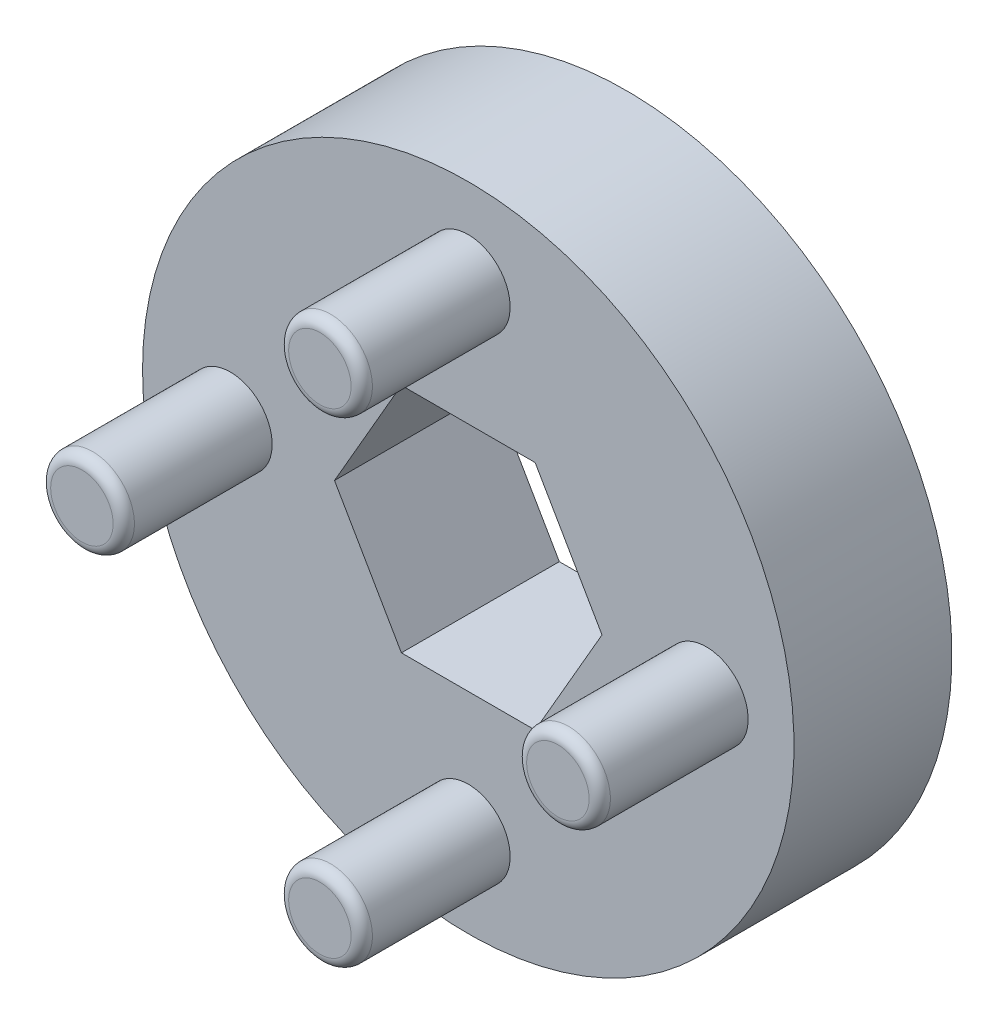
ISO-10303-21;
HEADER;
FILE_DESCRIPTION(('STEP AP214'),'2;1');
FILE_NAME('part.step','',(''),(''),'','','');
FILE_SCHEMA(('AUTOMOTIVE_DESIGN { 1 0 10303 214 1 1 1 1 }'));
ENDSEC;
DATA;
#1=APPLICATION_CONTEXT('core data for automotive mechanical design processes');
#2=APPLICATION_PROTOCOL_DEFINITION('international standard','automotive_design',2000,#1);
#3=PRODUCT_CONTEXT('',#1,'mechanical');
#4=PRODUCT('Part','Part','',(#3));
#5=PRODUCT_RELATED_PRODUCT_CATEGORY('part','',(#4));
#6=PRODUCT_DEFINITION_FORMATION('','',#4);
#7=PRODUCT_DEFINITION_CONTEXT('part definition',#1,'design');
#8=PRODUCT_DEFINITION('design','',#6,#7);
#9=PRODUCT_DEFINITION_SHAPE('','',#8);
#10=(LENGTH_UNIT() NAMED_UNIT(*) SI_UNIT(.MILLI.,.METRE.));
#11=(NAMED_UNIT(*) PLANE_ANGLE_UNIT() SI_UNIT($,.RADIAN.));
#12=(NAMED_UNIT(*) SI_UNIT($,.STERADIAN.) SOLID_ANGLE_UNIT());
#13=UNCERTAINTY_MEASURE_WITH_UNIT(LENGTH_MEASURE(1.E-05),#10,'distance_accuracy_value','');
#14=(GEOMETRIC_REPRESENTATION_CONTEXT(3) GLOBAL_UNCERTAINTY_ASSIGNED_CONTEXT((#13)) GLOBAL_UNIT_ASSIGNED_CONTEXT((#10,
#11,#12)) REPRESENTATION_CONTEXT('',''));
#15=CARTESIAN_POINT('',(0.,0.,0.));
#16=DIRECTION('',(0.,0.,1.));
#17=DIRECTION('',(1.,0.,0.));
#18=AXIS2_PLACEMENT_3D('',#15,#16,#17);
#19=CARTESIAN_POINT('',(-11.3665,1.19057767913881E-13,14.6304));
#20=DIRECTION('',(0.,0.,1.));
#21=DIRECTION('',(1.,0.,0.));
#22=AXIS2_PLACEMENT_3D('',#19,#20,#21);
#23=PLANE('',#22);
#24=CARTESIAN_POINT('',(-11.3665,1.19057767913881E-13,14.6304));
#25=DIRECTION('',(0.,0.,-1.));
#26=DIRECTION('',(-1.,0.,0.));
#27=AXIS2_PLACEMENT_3D('',#24,#25,#26);
#28=CIRCLE('',#27,1.49225);
#29=CARTESIAN_POINT('',(-12.85875,1.19252958243964E-13,14.6304));
#30=VERTEX_POINT('',#29);
#31=CARTESIAN_POINT('',(-9.87425,1.19057767913881E-13,14.6304));
#32=VERTEX_POINT('',#31);
#33=EDGE_CURVE('E95',#30,#32,#28,.T.);
#34=ORIENTED_EDGE('',*,*,#33,.F.);
#35=CARTESIAN_POINT('',(-11.3665,1.19057767913881E-13,14.6304));
#36=DIRECTION('',(0.,0.,-1.));
#37=DIRECTION('',(1.,0.,0.));
#38=AXIS2_PLACEMENT_3D('',#35,#36,#37);
#39=CIRCLE('',#38,1.49225);
#40=EDGE_CURVE('E93',#32,#30,#39,.T.);
#41=ORIENTED_EDGE('',*,*,#40,.F.);
#42=EDGE_LOOP('',(#34,#41));
#43=FACE_BOUND('',#42,.T.);
#44=ADVANCED_FACE('F17',(#43),#23,.T.);
#45=CARTESIAN_POINT('',(0.,-11.3665,14.6304));
#46=DIRECTION('',(0.,0.,1.));
#47=DIRECTION('',(1.,0.,0.));
#48=AXIS2_PLACEMENT_3D('',#45,#46,#47);
#49=PLANE('',#48);
#50=CARTESIAN_POINT('',(0.,-11.3665,14.6304));
#51=DIRECTION('',(0.,0.,-1.));
#52=DIRECTION('',(-1.,0.,0.));
#53=AXIS2_PLACEMENT_3D('',#50,#51,#52);
#54=CIRCLE('',#53,1.49225);
#55=CARTESIAN_POINT('',(-1.49225,-11.3665,14.6304));
#56=VERTEX_POINT('',#55);
#57=CARTESIAN_POINT('',(1.49225,-11.3665,14.6304));
#58=VERTEX_POINT('',#57);
#59=EDGE_CURVE('E330',#56,#58,#54,.T.);
#60=ORIENTED_EDGE('',*,*,#59,.F.);
#61=CARTESIAN_POINT('',(0.,-11.3665,14.6304));
#62=DIRECTION('',(0.,0.,-1.));
#63=DIRECTION('',(1.,0.,0.));
#64=AXIS2_PLACEMENT_3D('',#61,#62,#63);
#65=CIRCLE('',#64,1.49225);
#66=EDGE_CURVE('E101',#58,#56,#65,.T.);
#67=ORIENTED_EDGE('',*,*,#66,.F.);
#68=EDGE_LOOP('',(#60,#67));
#69=FACE_BOUND('',#68,.T.);
#70=ADVANCED_FACE('F334',(#69),#49,.T.);
#71=CARTESIAN_POINT('',(11.3665,0.,14.6304));
#72=DIRECTION('',(0.,0.,1.));
#73=DIRECTION('',(1.,0.,0.));
#74=AXIS2_PLACEMENT_3D('',#71,#72,#73);
#75=PLANE('',#74);
#76=CARTESIAN_POINT('',(11.3665,0.,14.6304));
#77=DIRECTION('',(0.,0.,-1.));
#78=DIRECTION('',(-1.,0.,0.));
#79=AXIS2_PLACEMENT_3D('',#76,#77,#78);
#80=CIRCLE('',#79,1.49225);
#81=CARTESIAN_POINT('',(9.87425,0.,14.6304));
#82=VERTEX_POINT('',#81);
#83=CARTESIAN_POINT('',(12.85875,0.,14.6304));
#84=VERTEX_POINT('',#83);
#85=EDGE_CURVE('E495',#82,#84,#80,.T.);
#86=ORIENTED_EDGE('',*,*,#85,.F.);
#87=CARTESIAN_POINT('',(11.3665,0.,14.6304));
#88=DIRECTION('',(0.,0.,-1.));
#89=DIRECTION('',(1.,0.,0.));
#90=AXIS2_PLACEMENT_3D('',#87,#88,#89);
#91=CIRCLE('',#90,1.49225);
#92=EDGE_CURVE('E311',#84,#82,#91,.T.);
#93=ORIENTED_EDGE('',*,*,#92,.F.);
#94=EDGE_LOOP('',(#86,#93));
#95=FACE_BOUND('',#94,.T.);
#96=ADVANCED_FACE('F171',(#95),#75,.T.);
#97=CARTESIAN_POINT('',(0.,11.3665,14.6304));
#98=DIRECTION('',(0.,0.,1.));
#99=DIRECTION('',(1.,0.,0.));
#100=AXIS2_PLACEMENT_3D('',#97,#98,#99);
#101=PLANE('',#100);
#102=CARTESIAN_POINT('',(0.,11.3665,14.6304));
#103=DIRECTION('',(0.,0.,-1.));
#104=DIRECTION('',(-1.,0.,0.));
#105=AXIS2_PLACEMENT_3D('',#102,#103,#104);
#106=CIRCLE('',#105,1.49225);
#107=CARTESIAN_POINT('',(-1.49225,11.3665,14.6304));
#108=VERTEX_POINT('',#107);
#109=CARTESIAN_POINT('',(1.49225,11.3665,14.6304));
#110=VERTEX_POINT('',#109);
#111=EDGE_CURVE('E151',#108,#110,#106,.T.);
#112=ORIENTED_EDGE('',*,*,#111,.F.);
#113=CARTESIAN_POINT('',(0.,11.3665,14.6304));
#114=DIRECTION('',(0.,0.,-1.));
#115=DIRECTION('',(1.,0.,0.));
#116=AXIS2_PLACEMENT_3D('',#113,#114,#115);
#117=CIRCLE('',#116,1.49225);
#118=EDGE_CURVE('E299',#110,#108,#117,.T.);
#119=ORIENTED_EDGE('',*,*,#118,.F.);
#120=EDGE_LOOP('',(#112,#119));
#121=FACE_BOUND('',#120,.T.);
#122=ADVANCED_FACE('F162',(#121),#101,.T.);
#123=CARTESIAN_POINT('',(-11.3665,1.19057767913881E-13,14.1224));
#124=DIRECTION('',(0.,0.,1.));
#125=DIRECTION('',(1.,0.,0.));
#126=AXIS2_PLACEMENT_3D('',#123,#124,#125);
#127=TOROIDAL_SURFACE('',#126,1.49225,0.508);
#128=ORIENTED_EDGE('',*,*,#40,.T.);
#129=ORIENTED_EDGE('',*,*,#33,.T.);
#130=EDGE_LOOP('',(#128,#129));
#131=FACE_BOUND('',#130,.T.);
#132=CARTESIAN_POINT('',(-11.3665,1.19057767913881E-13,14.1224));
#133=DIRECTION('',(0.,0.,-1.));
#134=DIRECTION('',(-1.,0.,0.));
#135=AXIS2_PLACEMENT_3D('',#132,#133,#134);
#136=CIRCLE('',#135,2.00025);
#137=CARTESIAN_POINT('',(-13.36675,1.19057767913881E-13,14.1224));
#138=VERTEX_POINT('',#137);
#139=EDGE_CURVE('E149',#138,#138,#136,.T.);
#140=ORIENTED_EDGE('',*,*,#139,.F.);
#141=EDGE_LOOP('',(#140));
#142=FACE_BOUND('',#141,.T.);
#143=ADVANCED_FACE('F97',(#131,#142),#127,.T.);
#144=CARTESIAN_POINT('',(0.,-11.3665,14.1224));
#145=DIRECTION('',(0.,0.,1.));
#146=DIRECTION('',(1.,0.,0.));
#147=AXIS2_PLACEMENT_3D('',#144,#145,#146);
#148=TOROIDAL_SURFACE('',#147,1.49225,0.508);
#149=ORIENTED_EDGE('',*,*,#66,.T.);
#150=ORIENTED_EDGE('',*,*,#59,.T.);
#151=EDGE_LOOP('',(#149,#150));
#152=FACE_BOUND('',#151,.T.);
#153=CARTESIAN_POINT('',(0.,-11.3665,14.1224));
#154=DIRECTION('',(0.,0.,-1.));
#155=DIRECTION('',(-1.,0.,0.));
#156=AXIS2_PLACEMENT_3D('',#153,#154,#155);
#157=CIRCLE('',#156,2.00025);
#158=CARTESIAN_POINT('',(-2.00025,-11.3665,14.1224));
#159=VERTEX_POINT('',#158);
#160=EDGE_CURVE('E148',#159,#159,#157,.T.);
#161=ORIENTED_EDGE('',*,*,#160,.F.);
#162=EDGE_LOOP('',(#161));
#163=FACE_BOUND('',#162,.T.);
#164=ADVANCED_FACE('F126',(#152,#163),#148,.T.);
#165=CARTESIAN_POINT('',(11.3665,0.,14.1224));
#166=DIRECTION('',(0.,0.,1.));
#167=DIRECTION('',(1.,0.,0.));
#168=AXIS2_PLACEMENT_3D('',#165,#166,#167);
#169=TOROIDAL_SURFACE('',#168,1.49225,0.508);
#170=ORIENTED_EDGE('',*,*,#92,.T.);
#171=ORIENTED_EDGE('',*,*,#85,.T.);
#172=EDGE_LOOP('',(#170,#171));
#173=FACE_BOUND('',#172,.T.);
#174=CARTESIAN_POINT('',(11.3665,0.,14.1224));
#175=DIRECTION('',(0.,0.,-1.));
#176=DIRECTION('',(-1.,0.,0.));
#177=AXIS2_PLACEMENT_3D('',#174,#175,#176);
#178=CIRCLE('',#177,2.00025);
#179=CARTESIAN_POINT('',(9.36625,0.,14.1224));
#180=VERTEX_POINT('',#179);
#181=EDGE_CURVE('E207',#180,#180,#178,.T.);
#182=ORIENTED_EDGE('',*,*,#181,.F.);
#183=EDGE_LOOP('',(#182));
#184=FACE_BOUND('',#183,.T.);
#185=ADVANCED_FACE('F136',(#173,#184),#169,.T.);
#186=CARTESIAN_POINT('',(0.,11.3665,14.1224));
#187=DIRECTION('',(0.,0.,1.));
#188=DIRECTION('',(1.,0.,0.));
#189=AXIS2_PLACEMENT_3D('',#186,#187,#188);
#190=TOROIDAL_SURFACE('',#189,1.49225,0.508);
#191=ORIENTED_EDGE('',*,*,#118,.T.);
#192=ORIENTED_EDGE('',*,*,#111,.T.);
#193=EDGE_LOOP('',(#191,#192));
#194=FACE_BOUND('',#193,.T.);
#195=CARTESIAN_POINT('',(0.,11.3665,14.1224));
#196=DIRECTION('',(0.,0.,-1.));
#197=DIRECTION('',(-1.,0.,0.));
#198=AXIS2_PLACEMENT_3D('',#195,#196,#197);
#199=CIRCLE('',#198,2.00025);
#200=CARTESIAN_POINT('',(-2.00025,11.3665,14.1224));
#201=VERTEX_POINT('',#200);
#202=EDGE_CURVE('E205',#201,#201,#199,.T.);
#203=ORIENTED_EDGE('',*,*,#202,.F.);
#204=EDGE_LOOP('',(#203));
#205=FACE_BOUND('',#204,.T.);
#206=ADVANCED_FACE('F189',(#194,#205),#190,.T.);
#207=CARTESIAN_POINT('',(-11.3665,1.19057767913881E-13,14.6304));
#208=DIRECTION('',(0.,0.,-1.));
#209=DIRECTION('',(-1.,0.,0.));
#210=AXIS2_PLACEMENT_3D('',#207,#208,#209);
#211=CYLINDRICAL_SURFACE('',#210,2.00025);
#212=CARTESIAN_POINT('',(-11.3665,1.19057767913881E-13,7.5438));
#213=DIRECTION('',(0.,0.,-1.));
#214=DIRECTION('',(-1.,0.,0.));
#215=AXIS2_PLACEMENT_3D('',#212,#213,#214);
#216=CIRCLE('',#215,2.00025);
#217=CARTESIAN_POINT('',(-13.36675,1.19057767913881E-13,7.5438));
#218=VERTEX_POINT('',#217);
#219=EDGE_CURVE('E213',#218,#218,#216,.T.);
#220=ORIENTED_EDGE('',*,*,#219,.F.);
#221=EDGE_LOOP('',(#220));
#222=FACE_BOUND('',#221,.T.);
#223=ORIENTED_EDGE('',*,*,#139,.T.);
#224=EDGE_LOOP('',(#223));
#225=FACE_BOUND('',#224,.T.);
#226=ADVANCED_FACE('F199',(#222,#225),#211,.T.);
#227=CARTESIAN_POINT('',(0.,-11.3665,14.6304));
#228=DIRECTION('',(0.,0.,-1.));
#229=DIRECTION('',(-1.,0.,0.));
#230=AXIS2_PLACEMENT_3D('',#227,#228,#229);
#231=CYLINDRICAL_SURFACE('',#230,2.00025);
#232=CARTESIAN_POINT('',(0.,-11.3665,7.5438));
#233=DIRECTION('',(0.,0.,-1.));
#234=DIRECTION('',(-1.,0.,0.));
#235=AXIS2_PLACEMENT_3D('',#232,#233,#234);
#236=CIRCLE('',#235,2.00025);
#237=CARTESIAN_POINT('',(-2.00025,-11.3665,7.5438));
#238=VERTEX_POINT('',#237);
#239=EDGE_CURVE('E290',#238,#238,#236,.T.);
#240=ORIENTED_EDGE('',*,*,#239,.F.);
#241=EDGE_LOOP('',(#240));
#242=FACE_BOUND('',#241,.T.);
#243=ORIENTED_EDGE('',*,*,#160,.T.);
#244=EDGE_LOOP('',(#243));
#245=FACE_BOUND('',#244,.T.);
#246=ADVANCED_FACE('F217',(#242,#245),#231,.T.);
#247=CARTESIAN_POINT('',(11.3665,0.,14.6304));
#248=DIRECTION('',(0.,0.,-1.));
#249=DIRECTION('',(-1.,0.,0.));
#250=AXIS2_PLACEMENT_3D('',#247,#248,#249);
#251=CYLINDRICAL_SURFACE('',#250,2.00025);
#252=CARTESIAN_POINT('',(11.3665,0.,7.5438));
#253=DIRECTION('',(0.,0.,-1.));
#254=DIRECTION('',(-1.,0.,0.));
#255=AXIS2_PLACEMENT_3D('',#252,#253,#254);
#256=CIRCLE('',#255,2.00025);
#257=CARTESIAN_POINT('',(9.36625,0.,7.5438));
#258=VERTEX_POINT('',#257);
#259=EDGE_CURVE('E284',#258,#258,#256,.T.);
#260=ORIENTED_EDGE('',*,*,#259,.F.);
#261=EDGE_LOOP('',(#260));
#262=FACE_BOUND('',#261,.T.);
#263=ORIENTED_EDGE('',*,*,#181,.T.);
#264=EDGE_LOOP('',(#263));
#265=FACE_BOUND('',#264,.T.);
#266=ADVANCED_FACE('F220',(#262,#265),#251,.T.);
#267=CARTESIAN_POINT('',(0.,11.3665,14.6304));
#268=DIRECTION('',(0.,0.,-1.));
#269=DIRECTION('',(-1.,0.,0.));
#270=AXIS2_PLACEMENT_3D('',#267,#268,#269);
#271=CYLINDRICAL_SURFACE('',#270,2.00025);
#272=CARTESIAN_POINT('',(0.,11.3665,7.5438));
#273=DIRECTION('',(0.,0.,-1.));
#274=DIRECTION('',(-1.,0.,0.));
#275=AXIS2_PLACEMENT_3D('',#272,#273,#274);
#276=CIRCLE('',#275,2.00025);
#277=CARTESIAN_POINT('',(-2.00025,11.3665,7.5438));
#278=VERTEX_POINT('',#277);
#279=EDGE_CURVE('E279',#278,#278,#276,.T.);
#280=ORIENTED_EDGE('',*,*,#279,.F.);
#281=EDGE_LOOP('',(#280));
#282=FACE_BOUND('',#281,.T.);
#283=ORIENTED_EDGE('',*,*,#202,.T.);
#284=EDGE_LOOP('',(#283));
#285=FACE_BOUND('',#284,.T.);
#286=ADVANCED_FACE('F227',(#282,#285),#271,.T.);
#287=CARTESIAN_POINT('',(0.,0.,7.5438));
#288=DIRECTION('',(0.,0.,1.));
#289=DIRECTION('',(1.,0.,0.));
#290=AXIS2_PLACEMENT_3D('',#287,#288,#289);
#291=PLANE('',#290);
#292=DIRECTION('',(0.5,0.866025403784439,0.));
#293=VECTOR('',#292,1.);
#294=CARTESIAN_POINT('',(-3.19405,5.53225688191537,7.5438));
#295=LINE('',#294,#293);
#296=CARTESIAN_POINT('',(-3.19405,5.53225688191537,7.5438));
#297=VERTEX_POINT('',#296);
#298=CARTESIAN_POINT('',(-6.3881,0.,7.5438));
#299=VERTEX_POINT('',#298);
#300=EDGE_CURVE('E555',#297,#299,#295,.F.);
#301=ORIENTED_EDGE('',*,*,#300,.F.);
#302=DIRECTION('',(1.,0.,0.));
#303=VECTOR('',#302,1.);
#304=CARTESIAN_POINT('',(3.19405,5.53225688191537,7.5438));
#305=LINE('',#304,#303);
#306=CARTESIAN_POINT('',(3.19405,5.53225688191537,7.5438));
#307=VERTEX_POINT('',#306);
#308=EDGE_CURVE('E551',#307,#297,#305,.F.);
#309=ORIENTED_EDGE('',*,*,#308,.F.);
#310=DIRECTION('',(0.5,-0.866025403784439,0.));
#311=VECTOR('',#310,1.);
#312=CARTESIAN_POINT('',(6.3881,0.,7.5438));
#313=LINE('',#312,#311);
#314=CARTESIAN_POINT('',(6.3881,0.,7.5438));
#315=VERTEX_POINT('',#314);
#316=EDGE_CURVE('E547',#315,#307,#313,.F.);
#317=ORIENTED_EDGE('',*,*,#316,.F.);
#318=DIRECTION('',(-0.499999999999999,-0.866025403784439,0.));
#319=VECTOR('',#318,1.);
#320=CARTESIAN_POINT('',(3.19405,-5.53225688191537,7.5438));
#321=LINE('',#320,#319);
#322=CARTESIAN_POINT('',(3.19405,-5.53225688191537,7.5438));
#323=VERTEX_POINT('',#322);
#324=EDGE_CURVE('E537',#323,#315,#321,.F.);
#325=ORIENTED_EDGE('',*,*,#324,.F.);
#326=DIRECTION('',(1.,0.,0.));
#327=VECTOR('',#326,1.);
#328=CARTESIAN_POINT('',(-3.19405,-5.53225688191537,7.5438));
#329=LINE('',#328,#327);
#330=CARTESIAN_POINT('',(-3.19405,-5.53225688191537,7.5438));
#331=VERTEX_POINT('',#330);
#332=EDGE_CURVE('E287',#331,#323,#329,.T.);
#333=ORIENTED_EDGE('',*,*,#332,.F.);
#334=DIRECTION('',(-0.5,0.866025403784438,0.));
#335=VECTOR('',#334,1.);
#336=CARTESIAN_POINT('',(-6.3881,0.,7.5438));
#337=LINE('',#336,#335);
#338=EDGE_CURVE('E559',#299,#331,#337,.F.);
#339=ORIENTED_EDGE('',*,*,#338,.F.);
#340=EDGE_LOOP('',(#301,#309,#317,#325,#333,#339));
#341=FACE_BOUND('',#340,.T.);
#342=CARTESIAN_POINT('',(0.,0.,7.5438));
#343=DIRECTION('',(0.,0.,-1.));
#344=DIRECTION('',(-1.,0.,0.));
#345=AXIS2_PLACEMENT_3D('',#342,#343,#344);
#346=CIRCLE('',#345,15.5575);
#347=CARTESIAN_POINT('',(-15.5575,0.,7.5438));
#348=VERTEX_POINT('',#347);
#349=EDGE_CURVE('E283',#348,#348,#346,.T.);
#350=ORIENTED_EDGE('',*,*,#349,.F.);
#351=EDGE_LOOP('',(#350));
#352=FACE_BOUND('',#351,.T.);
#353=ORIENTED_EDGE('',*,*,#279,.T.);
#354=EDGE_LOOP('',(#353));
#355=FACE_BOUND('',#354,.T.);
#356=ORIENTED_EDGE('',*,*,#259,.T.);
#357=EDGE_LOOP('',(#356));
#358=FACE_BOUND('',#357,.T.);
#359=ORIENTED_EDGE('',*,*,#239,.T.);
#360=EDGE_LOOP('',(#359));
#361=FACE_BOUND('',#360,.T.);
#362=ORIENTED_EDGE('',*,*,#219,.T.);
#363=EDGE_LOOP('',(#362));
#364=FACE_BOUND('',#363,.T.);
#365=ADVANCED_FACE('F267',(#341,#352,#355,#358,#361,#364),#291,.T.);
#366=CARTESIAN_POINT('',(0.,0.,7.5438));
#367=DIRECTION('',(0.,0.,-1.));
#368=DIRECTION('',(-1.,0.,0.));
#369=AXIS2_PLACEMENT_3D('',#366,#367,#368);
#370=CYLINDRICAL_SURFACE('',#369,15.5575);
#371=ORIENTED_EDGE('',*,*,#349,.T.);
#372=EDGE_LOOP('',(#371));
#373=FACE_BOUND('',#372,.T.);
#374=CARTESIAN_POINT('',(0.,0.,0.));
#375=DIRECTION('',(0.,0.,-1.));
#376=DIRECTION('',(-1.,0.,0.));
#377=AXIS2_PLACEMENT_3D('',#374,#375,#376);
#378=CIRCLE('',#377,15.5575);
#379=CARTESIAN_POINT('',(-15.5575,0.,0.));
#380=VERTEX_POINT('',#379);
#381=EDGE_CURVE('E522',#380,#380,#378,.F.);
#382=ORIENTED_EDGE('',*,*,#381,.T.);
#383=EDGE_LOOP('',(#382));
#384=FACE_BOUND('',#383,.T.);
#385=ADVANCED_FACE('F263',(#373,#384),#370,.T.);
#386=CARTESIAN_POINT('',(-3.19405,-5.53225688191537,7.5438));
#387=DIRECTION('',(0.,1.,0.));
#388=DIRECTION('',(0.,0.,1.));
#389=AXIS2_PLACEMENT_3D('',#386,#387,#388);
#390=PLANE('',#389);
#391=ORIENTED_EDGE('',*,*,#332,.T.);
#392=DIRECTION('',(0.,0.,1.));
#393=VECTOR('',#392,1.);
#394=CARTESIAN_POINT('',(3.19405,-5.53225688191537,7.5438));
#395=LINE('',#394,#393);
#396=CARTESIAN_POINT('',(3.19405,-5.53225688191537,0.));
#397=VERTEX_POINT('',#396);
#398=EDGE_CURVE('E539',#397,#323,#395,.T.);
#399=ORIENTED_EDGE('',*,*,#398,.F.);
#400=DIRECTION('',(1.,0.,0.));
#401=VECTOR('',#400,1.);
#402=CARTESIAN_POINT('',(0.,-5.53225688191537,0.));
#403=LINE('',#402,#401);
#404=CARTESIAN_POINT('',(-3.19405,-5.53225688191537,0.));
#405=VERTEX_POINT('',#404);
#406=EDGE_CURVE('E524',#397,#405,#403,.F.);
#407=ORIENTED_EDGE('',*,*,#406,.T.);
#408=DIRECTION('',(0.,0.,1.));
#409=VECTOR('',#408,1.);
#410=CARTESIAN_POINT('',(-3.19404999999999,-5.53225688191537,7.5438));
#411=LINE('',#410,#409);
#412=EDGE_CURVE('E557',#331,#405,#411,.F.);
#413=ORIENTED_EDGE('',*,*,#412,.F.);
#414=EDGE_LOOP('',(#391,#399,#407,#413));
#415=FACE_BOUND('',#414,.T.);
#416=ADVANCED_FACE('F259',(#415),#390,.T.);
#417=CARTESIAN_POINT('',(-6.3881,0.,7.5438));
#418=DIRECTION('',(0.866025403784438,0.5,0.));
#419=DIRECTION('',(-0.5,0.866025403784438,0.));
#420=AXIS2_PLACEMENT_3D('',#417,#418,#419);
#421=PLANE('',#420);
#422=ORIENTED_EDGE('',*,*,#338,.T.);
#423=ORIENTED_EDGE('',*,*,#412,.T.);
#424=DIRECTION('',(-0.5,0.866025403784438,0.));
#425=VECTOR('',#424,1.);
#426=CARTESIAN_POINT('',(-3.19405,-5.53225688191537,0.));
#427=LINE('',#426,#425);
#428=CARTESIAN_POINT('',(-6.3881,0.,0.));
#429=VERTEX_POINT('',#428);
#430=EDGE_CURVE('E535',#405,#429,#427,.T.);
#431=ORIENTED_EDGE('',*,*,#430,.T.);
#432=DIRECTION('',(0.,0.,1.));
#433=VECTOR('',#432,1.);
#434=CARTESIAN_POINT('',(-6.3881,0.,7.5438));
#435=LINE('',#434,#433);
#436=EDGE_CURVE('E553',#299,#429,#435,.F.);
#437=ORIENTED_EDGE('',*,*,#436,.F.);
#438=EDGE_LOOP('',(#422,#423,#431,#437));
#439=FACE_BOUND('',#438,.T.);
#440=ADVANCED_FACE('F255',(#439),#421,.T.);
#441=CARTESIAN_POINT('',(-3.19405,5.53225688191537,7.5438));
#442=DIRECTION('',(0.866025403784439,-0.5,0.));
#443=DIRECTION('',(0.5,0.866025403784439,0.));
#444=AXIS2_PLACEMENT_3D('',#441,#442,#443);
#445=PLANE('',#444);
#446=ORIENTED_EDGE('',*,*,#300,.T.);
#447=ORIENTED_EDGE('',*,*,#436,.T.);
#448=DIRECTION('',(0.5,0.866025403784439,0.));
#449=VECTOR('',#448,1.);
#450=CARTESIAN_POINT('',(-6.3881,0.,0.));
#451=LINE('',#450,#449);
#452=CARTESIAN_POINT('',(-3.19405,5.53225688191537,0.));
#453=VERTEX_POINT('',#452);
#454=EDGE_CURVE('E575',#429,#453,#451,.T.);
#455=ORIENTED_EDGE('',*,*,#454,.T.);
#456=DIRECTION('',(0.,0.,1.));
#457=VECTOR('',#456,1.);
#458=CARTESIAN_POINT('',(-3.19405,5.53225688191537,7.5438));
#459=LINE('',#458,#457);
#460=EDGE_CURVE('E549',#297,#453,#459,.F.);
#461=ORIENTED_EDGE('',*,*,#460,.F.);
#462=EDGE_LOOP('',(#446,#447,#455,#461));
#463=FACE_BOUND('',#462,.T.);
#464=ADVANCED_FACE('F251',(#463),#445,.T.);
#465=CARTESIAN_POINT('',(3.19405,5.53225688191537,7.5438));
#466=DIRECTION('',(0.,-1.,0.));
#467=DIRECTION('',(1.,0.,0.));
#468=AXIS2_PLACEMENT_3D('',#465,#466,#467);
#469=PLANE('',#468);
#470=ORIENTED_EDGE('',*,*,#308,.T.);
#471=ORIENTED_EDGE('',*,*,#460,.T.);
#472=DIRECTION('',(1.,0.,0.));
#473=VECTOR('',#472,1.);
#474=CARTESIAN_POINT('',(0.,5.53225688191537,0.));
#475=LINE('',#474,#473);
#476=CARTESIAN_POINT('',(3.19405,5.53225688191537,0.));
#477=VERTEX_POINT('',#476);
#478=EDGE_CURVE('E573',#453,#477,#475,.T.);
#479=ORIENTED_EDGE('',*,*,#478,.T.);
#480=DIRECTION('',(0.,0.,1.));
#481=VECTOR('',#480,1.);
#482=CARTESIAN_POINT('',(3.19405,5.53225688191537,7.5438));
#483=LINE('',#482,#481);
#484=EDGE_CURVE('E545',#307,#477,#483,.F.);
#485=ORIENTED_EDGE('',*,*,#484,.F.);
#486=EDGE_LOOP('',(#470,#471,#479,#485));
#487=FACE_BOUND('',#486,.T.);
#488=ADVANCED_FACE('F247',(#487),#469,.T.);
#489=CARTESIAN_POINT('',(6.3881,0.,7.5438));
#490=DIRECTION('',(-0.866025403784439,-0.5,0.));
#491=DIRECTION('',(0.5,-0.866025403784439,0.));
#492=AXIS2_PLACEMENT_3D('',#489,#490,#491);
#493=PLANE('',#492);
#494=ORIENTED_EDGE('',*,*,#316,.T.);
#495=ORIENTED_EDGE('',*,*,#484,.T.);
#496=DIRECTION('',(0.5,-0.866025403784439,0.));
#497=VECTOR('',#496,1.);
#498=CARTESIAN_POINT('',(3.19405,5.53225688191537,0.));
#499=LINE('',#498,#497);
#500=CARTESIAN_POINT('',(6.3881,0.,0.));
#501=VERTEX_POINT('',#500);
#502=EDGE_CURVE('E29',#477,#501,#499,.T.);
#503=ORIENTED_EDGE('',*,*,#502,.T.);
#504=DIRECTION('',(0.,0.,1.));
#505=VECTOR('',#504,1.);
#506=CARTESIAN_POINT('',(6.3881,0.,7.5438));
#507=LINE('',#506,#505);
#508=EDGE_CURVE('E37',#315,#501,#507,.F.);
#509=ORIENTED_EDGE('',*,*,#508,.F.);
#510=EDGE_LOOP('',(#494,#495,#503,#509));
#511=FACE_BOUND('',#510,.T.);
#512=ADVANCED_FACE('F240',(#511),#493,.T.);
#513=CARTESIAN_POINT('',(3.19405,-5.53225688191537,7.5438));
#514=DIRECTION('',(-0.866025403784439,0.499999999999999,0.));
#515=DIRECTION('',(-0.499999999999999,-0.866025403784439,0.));
#516=AXIS2_PLACEMENT_3D('',#513,#514,#515);
#517=PLANE('',#516);
#518=ORIENTED_EDGE('',*,*,#324,.T.);
#519=ORIENTED_EDGE('',*,*,#508,.T.);
#520=DIRECTION('',(-0.499999999999999,-0.866025403784439,0.));
#521=VECTOR('',#520,1.);
#522=CARTESIAN_POINT('',(6.3881,0.,0.));
#523=LINE('',#522,#521);
#524=EDGE_CURVE('E11',#501,#397,#523,.T.);
#525=ORIENTED_EDGE('',*,*,#524,.T.);
#526=ORIENTED_EDGE('',*,*,#398,.T.);
#527=EDGE_LOOP('',(#518,#519,#525,#526));
#528=FACE_BOUND('',#527,.T.);
#529=ADVANCED_FACE('F234',(#528),#517,.T.);
#530=CARTESIAN_POINT('',(0.,0.,0.));
#531=DIRECTION('',(0.,0.,1.));
#532=DIRECTION('',(1.,0.,0.));
#533=AXIS2_PLACEMENT_3D('',#530,#531,#532);
#534=PLANE('',#533);
#535=ORIENTED_EDGE('',*,*,#502,.F.);
#536=ORIENTED_EDGE('',*,*,#478,.F.);
#537=ORIENTED_EDGE('',*,*,#454,.F.);
#538=ORIENTED_EDGE('',*,*,#430,.F.);
#539=ORIENTED_EDGE('',*,*,#406,.F.);
#540=ORIENTED_EDGE('',*,*,#524,.F.);
#541=EDGE_LOOP('',(#535,#536,#537,#538,#539,#540));
#542=FACE_BOUND('',#541,.T.);
#543=ORIENTED_EDGE('',*,*,#381,.F.);
#544=EDGE_LOOP('',(#543));
#545=FACE_BOUND('',#544,.T.);
#546=ADVANCED_FACE('F232',(#542,#545),#534,.F.);
#547=CLOSED_SHELL('',(#44,#70,#96,#122,#143,#164,#185,#206,#226,#246,#266,#286,#365,#385,#416,
#440,#464,#488,#512,#529,#546));
#548=MANIFOLD_SOLID_BREP('B1',#547);
#549=ADVANCED_BREP_SHAPE_REPRESENTATION('',(#18,#548),#14);
#550=SHAPE_DEFINITION_REPRESENTATION(#9,#549);
ENDSEC;
END-ISO-10303-21;
